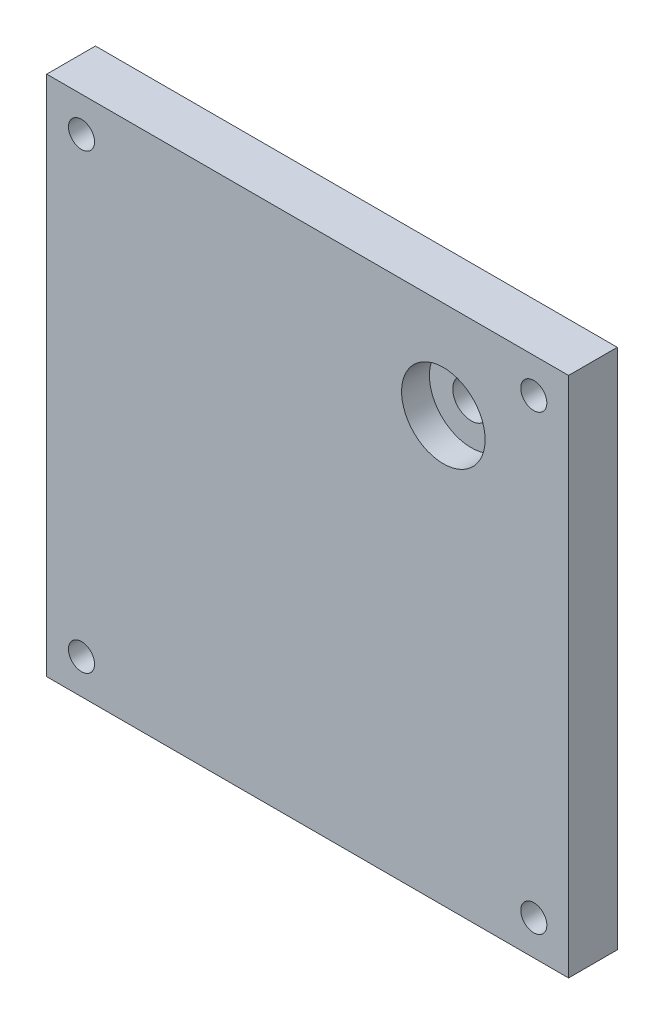
ISO-10303-21;
HEADER;
FILE_DESCRIPTION(('STEP AP214'),'2;1');
FILE_NAME('part.step','',(''),(''),'','','');
FILE_SCHEMA(('AUTOMOTIVE_DESIGN { 1 0 10303 214 1 1 1 1 }'));
ENDSEC;
DATA;
#1=APPLICATION_CONTEXT('core data for automotive mechanical design processes');
#2=APPLICATION_PROTOCOL_DEFINITION('international standard','automotive_design',2000,#1);
#3=PRODUCT_CONTEXT('',#1,'mechanical');
#4=PRODUCT('Part','Part','',(#3));
#5=PRODUCT_RELATED_PRODUCT_CATEGORY('part','',(#4));
#6=PRODUCT_DEFINITION_FORMATION('','',#4);
#7=PRODUCT_DEFINITION_CONTEXT('part definition',#1,'design');
#8=PRODUCT_DEFINITION('design','',#6,#7);
#9=PRODUCT_DEFINITION_SHAPE('','',#8);
#10=(LENGTH_UNIT() NAMED_UNIT(*) SI_UNIT(.MILLI.,.METRE.));
#11=(NAMED_UNIT(*) PLANE_ANGLE_UNIT() SI_UNIT($,.RADIAN.));
#12=(NAMED_UNIT(*) SI_UNIT($,.STERADIAN.) SOLID_ANGLE_UNIT());
#13=UNCERTAINTY_MEASURE_WITH_UNIT(LENGTH_MEASURE(1.E-05),#10,'distance_accuracy_value','');
#14=(GEOMETRIC_REPRESENTATION_CONTEXT(3) GLOBAL_UNCERTAINTY_ASSIGNED_CONTEXT((#13)) GLOBAL_UNIT_ASSIGNED_CONTEXT((#10,
#11,#12)) REPRESENTATION_CONTEXT('',''));
#15=CARTESIAN_POINT('',(0.,0.,0.));
#16=DIRECTION('',(0.,0.,1.));
#17=DIRECTION('',(1.,0.,0.));
#18=AXIS2_PLACEMENT_3D('',#15,#16,#17);
#19=CARTESIAN_POINT('',(47.625,-47.625,8.89));
#20=DIRECTION('',(-1.,0.,0.));
#21=DIRECTION('',(0.,0.,1.));
#22=AXIS2_PLACEMENT_3D('',#19,#20,#21);
#23=PLANE('',#22);
#24=DIRECTION('',(0.,1.,0.));
#25=VECTOR('',#24,1.);
#26=CARTESIAN_POINT('',(47.625,-47.625,0.));
#27=LINE('',#26,#25);
#28=CARTESIAN_POINT('',(47.625,-47.625,0.));
#29=VERTEX_POINT('',#28);
#30=CARTESIAN_POINT('',(47.625,47.625,0.));
#31=VERTEX_POINT('',#30);
#32=EDGE_CURVE('E108',#29,#31,#27,.T.);
#33=ORIENTED_EDGE('',*,*,#32,.T.);
#34=DIRECTION('',(0.,0.,-1.));
#35=VECTOR('',#34,1.);
#36=CARTESIAN_POINT('',(47.625,47.625,8.89));
#37=LINE('',#36,#35);
#38=CARTESIAN_POINT('',(47.625,47.625,8.89));
#39=VERTEX_POINT('',#38);
#40=EDGE_CURVE('E12',#39,#31,#37,.T.);
#41=ORIENTED_EDGE('',*,*,#40,.F.);
#42=DIRECTION('',(0.,1.,0.));
#43=VECTOR('',#42,1.);
#44=CARTESIAN_POINT('',(47.625,-47.625,8.89));
#45=LINE('',#44,#43);
#46=CARTESIAN_POINT('',(47.625,-47.625,8.89));
#47=VERTEX_POINT('',#46);
#48=EDGE_CURVE('E92',#47,#39,#45,.T.);
#49=ORIENTED_EDGE('',*,*,#48,.F.);
#50=DIRECTION('',(0.,0.,-1.));
#51=VECTOR('',#50,1.);
#52=CARTESIAN_POINT('',(47.625,-47.625,8.89));
#53=LINE('',#52,#51);
#54=EDGE_CURVE('E104',#47,#29,#53,.T.);
#55=ORIENTED_EDGE('',*,*,#54,.T.);
#56=EDGE_LOOP('',(#33,#41,#49,#55));
#57=FACE_BOUND('',#56,.T.);
#58=ADVANCED_FACE('F40',(#57),#23,.F.);
#59=CARTESIAN_POINT('',(-47.625,47.625,8.89));
#60=DIRECTION('',(0.,-1.,0.));
#61=DIRECTION('',(0.,0.,-1.));
#62=AXIS2_PLACEMENT_3D('',#59,#60,#61);
#63=PLANE('',#62);
#64=DIRECTION('',(-1.,0.,0.));
#65=VECTOR('',#64,1.);
#66=CARTESIAN_POINT('',(-47.625,47.625,0.));
#67=LINE('',#66,#65);
#68=CARTESIAN_POINT('',(-47.625,47.625,0.));
#69=VERTEX_POINT('',#68);
#70=EDGE_CURVE('E97',#31,#69,#67,.T.);
#71=ORIENTED_EDGE('',*,*,#70,.T.);
#72=DIRECTION('',(0.,0.,-1.));
#73=VECTOR('',#72,1.);
#74=CARTESIAN_POINT('',(-47.625,47.625,8.89));
#75=LINE('',#74,#73);
#76=CARTESIAN_POINT('',(-47.625,47.625,8.89));
#77=VERTEX_POINT('',#76);
#78=EDGE_CURVE('E49',#77,#69,#75,.T.);
#79=ORIENTED_EDGE('',*,*,#78,.F.);
#80=DIRECTION('',(-1.,0.,0.));
#81=VECTOR('',#80,1.);
#82=CARTESIAN_POINT('',(-47.625,47.625,8.89));
#83=LINE('',#82,#81);
#84=EDGE_CURVE('E87',#39,#77,#83,.T.);
#85=ORIENTED_EDGE('',*,*,#84,.F.);
#86=ORIENTED_EDGE('',*,*,#40,.T.);
#87=EDGE_LOOP('',(#71,#79,#85,#86));
#88=FACE_BOUND('',#87,.T.);
#89=ADVANCED_FACE('F96',(#88),#63,.F.);
#90=CARTESIAN_POINT('',(-47.625,-47.625,8.89));
#91=DIRECTION('',(1.,0.,0.));
#92=DIRECTION('',(0.,0.,-1.));
#93=AXIS2_PLACEMENT_3D('',#90,#91,#92);
#94=PLANE('',#93);
#95=DIRECTION('',(0.,-1.,0.));
#96=VECTOR('',#95,1.);
#97=CARTESIAN_POINT('',(-47.625,-47.625,0.));
#98=LINE('',#97,#96);
#99=CARTESIAN_POINT('',(-47.625,-47.625,0.));
#100=VERTEX_POINT('',#99);
#101=EDGE_CURVE('E74',#69,#100,#98,.T.);
#102=ORIENTED_EDGE('',*,*,#101,.T.);
#103=DIRECTION('',(0.,0.,-1.));
#104=VECTOR('',#103,1.);
#105=CARTESIAN_POINT('',(-47.625,-47.625,8.89));
#106=LINE('',#105,#104);
#107=CARTESIAN_POINT('',(-47.625,-47.625,8.89));
#108=VERTEX_POINT('',#107);
#109=EDGE_CURVE('E99',#108,#100,#106,.T.);
#110=ORIENTED_EDGE('',*,*,#109,.F.);
#111=DIRECTION('',(0.,-1.,0.));
#112=VECTOR('',#111,1.);
#113=CARTESIAN_POINT('',(-47.625,-47.625,8.89));
#114=LINE('',#113,#112);
#115=EDGE_CURVE('E90',#77,#108,#114,.T.);
#116=ORIENTED_EDGE('',*,*,#115,.F.);
#117=ORIENTED_EDGE('',*,*,#78,.T.);
#118=EDGE_LOOP('',(#102,#110,#116,#117));
#119=FACE_BOUND('',#118,.T.);
#120=ADVANCED_FACE('F100',(#119),#94,.F.);
#121=CARTESIAN_POINT('',(-47.625,-47.625,8.89));
#122=DIRECTION('',(0.,1.,0.));
#123=DIRECTION('',(0.,0.,1.));
#124=AXIS2_PLACEMENT_3D('',#121,#122,#123);
#125=PLANE('',#124);
#126=DIRECTION('',(1.,0.,0.));
#127=VECTOR('',#126,1.);
#128=CARTESIAN_POINT('',(-47.625,-47.625,0.));
#129=LINE('',#128,#127);
#130=EDGE_CURVE('E80',#100,#29,#129,.T.);
#131=ORIENTED_EDGE('',*,*,#130,.T.);
#132=ORIENTED_EDGE('',*,*,#54,.F.);
#133=DIRECTION('',(1.,0.,0.));
#134=VECTOR('',#133,1.);
#135=CARTESIAN_POINT('',(-47.625,-47.625,8.89));
#136=LINE('',#135,#134);
#137=EDGE_CURVE('E57',#108,#47,#136,.T.);
#138=ORIENTED_EDGE('',*,*,#137,.F.);
#139=ORIENTED_EDGE('',*,*,#109,.T.);
#140=EDGE_LOOP('',(#131,#132,#138,#139));
#141=FACE_BOUND('',#140,.T.);
#142=ADVANCED_FACE('F122',(#141),#125,.F.);
#143=CARTESIAN_POINT('',(0.,0.,8.89));
#144=DIRECTION('',(0.,0.,-1.));
#145=DIRECTION('',(-1.,0.,0.));
#146=AXIS2_PLACEMENT_3D('',#143,#144,#145);
#147=PLANE('',#146);
#148=CARTESIAN_POINT('',(24.765,29.845,8.89));
#149=DIRECTION('',(0.,0.,1.));
#150=DIRECTION('',(1.,0.,0.));
#151=AXIS2_PLACEMENT_3D('',#148,#149,#150);
#152=CIRCLE('',#151,7.62);
#153=CARTESIAN_POINT('',(32.385,29.845,8.89));
#154=VERTEX_POINT('',#153);
#155=EDGE_CURVE('E161',#154,#154,#152,.T.);
#156=ORIENTED_EDGE('',*,*,#155,.F.);
#157=EDGE_LOOP('',(#156));
#158=FACE_BOUND('',#157,.T.);
#159=CARTESIAN_POINT('',(41.275,-41.275,8.89));
#160=DIRECTION('',(0.,0.,1.));
#161=DIRECTION('',(1.,0.,0.));
#162=AXIS2_PLACEMENT_3D('',#159,#160,#161);
#163=CIRCLE('',#162,2.38125);
#164=CARTESIAN_POINT('',(43.65625,-41.275,8.89));
#165=VERTEX_POINT('',#164);
#166=EDGE_CURVE('E146',#165,#165,#163,.T.);
#167=ORIENTED_EDGE('',*,*,#166,.F.);
#168=EDGE_LOOP('',(#167));
#169=FACE_BOUND('',#168,.T.);
#170=CARTESIAN_POINT('',(-41.275,-41.275,8.89));
#171=DIRECTION('',(0.,0.,1.));
#172=DIRECTION('',(1.,0.,0.));
#173=AXIS2_PLACEMENT_3D('',#170,#171,#172);
#174=CIRCLE('',#173,2.38125);
#175=CARTESIAN_POINT('',(-38.89375,-41.275,8.89));
#176=VERTEX_POINT('',#175);
#177=EDGE_CURVE('E137',#176,#176,#174,.T.);
#178=ORIENTED_EDGE('',*,*,#177,.F.);
#179=EDGE_LOOP('',(#178));
#180=FACE_BOUND('',#179,.T.);
#181=CARTESIAN_POINT('',(-41.275,41.275,8.89));
#182=DIRECTION('',(0.,0.,1.));
#183=DIRECTION('',(1.,0.,0.));
#184=AXIS2_PLACEMENT_3D('',#181,#182,#183);
#185=CIRCLE('',#184,2.38125);
#186=CARTESIAN_POINT('',(-38.89375,41.275,8.89));
#187=VERTEX_POINT('',#186);
#188=EDGE_CURVE('E153',#187,#187,#185,.T.);
#189=ORIENTED_EDGE('',*,*,#188,.F.);
#190=EDGE_LOOP('',(#189));
#191=FACE_BOUND('',#190,.T.);
#192=CARTESIAN_POINT('',(41.275,41.275,8.89));
#193=DIRECTION('',(0.,0.,1.));
#194=DIRECTION('',(1.,0.,0.));
#195=AXIS2_PLACEMENT_3D('',#192,#193,#194);
#196=CIRCLE('',#195,2.38125);
#197=CARTESIAN_POINT('',(43.65625,41.275,8.89));
#198=VERTEX_POINT('',#197);
#199=EDGE_CURVE('E129',#198,#198,#196,.T.);
#200=ORIENTED_EDGE('',*,*,#199,.F.);
#201=EDGE_LOOP('',(#200));
#202=FACE_BOUND('',#201,.T.);
#203=ORIENTED_EDGE('',*,*,#48,.T.);
#204=ORIENTED_EDGE('',*,*,#84,.T.);
#205=ORIENTED_EDGE('',*,*,#115,.T.);
#206=ORIENTED_EDGE('',*,*,#137,.T.);
#207=EDGE_LOOP('',(#203,#204,#205,#206));
#208=FACE_BOUND('',#207,.T.);
#209=ADVANCED_FACE('F88',(#158,#169,#180,#191,#202,#208),#147,.F.);
#210=CARTESIAN_POINT('',(0.,0.,0.));
#211=DIRECTION('',(0.,0.,-1.));
#212=DIRECTION('',(-1.,0.,0.));
#213=AXIS2_PLACEMENT_3D('',#210,#211,#212);
#214=PLANE('',#213);
#215=CARTESIAN_POINT('',(24.765,29.845,0.));
#216=DIRECTION('',(0.,0.,1.));
#217=DIRECTION('',(1.,0.,0.));
#218=AXIS2_PLACEMENT_3D('',#215,#216,#217);
#219=CIRCLE('',#218,3.3655);
#220=CARTESIAN_POINT('',(28.1305,29.845,0.));
#221=VERTEX_POINT('',#220);
#222=EDGE_CURVE('E165',#221,#221,#219,.T.);
#223=ORIENTED_EDGE('',*,*,#222,.T.);
#224=EDGE_LOOP('',(#223));
#225=FACE_BOUND('',#224,.T.);
#226=CARTESIAN_POINT('',(41.275,-41.275,0.));
#227=DIRECTION('',(0.,0.,1.));
#228=DIRECTION('',(1.,0.,0.));
#229=AXIS2_PLACEMENT_3D('',#226,#227,#228);
#230=CIRCLE('',#229,2.38125);
#231=CARTESIAN_POINT('',(43.65625,-41.275,0.));
#232=VERTEX_POINT('',#231);
#233=EDGE_CURVE('E133',#232,#232,#230,.T.);
#234=ORIENTED_EDGE('',*,*,#233,.T.);
#235=EDGE_LOOP('',(#234));
#236=FACE_BOUND('',#235,.T.);
#237=CARTESIAN_POINT('',(-41.275,-41.275,0.));
#238=DIRECTION('',(0.,0.,1.));
#239=DIRECTION('',(1.,0.,0.));
#240=AXIS2_PLACEMENT_3D('',#237,#238,#239);
#241=CIRCLE('',#240,2.38125);
#242=CARTESIAN_POINT('',(-38.89375,-41.275,0.));
#243=VERTEX_POINT('',#242);
#244=EDGE_CURVE('E141',#243,#243,#241,.T.);
#245=ORIENTED_EDGE('',*,*,#244,.T.);
#246=EDGE_LOOP('',(#245));
#247=FACE_BOUND('',#246,.T.);
#248=CARTESIAN_POINT('',(-41.275,41.275,0.));
#249=DIRECTION('',(0.,0.,1.));
#250=DIRECTION('',(1.,0.,0.));
#251=AXIS2_PLACEMENT_3D('',#248,#249,#250);
#252=CIRCLE('',#251,2.38125);
#253=CARTESIAN_POINT('',(-38.89375,41.275,0.));
#254=VERTEX_POINT('',#253);
#255=EDGE_CURVE('E142',#254,#254,#252,.T.);
#256=ORIENTED_EDGE('',*,*,#255,.T.);
#257=EDGE_LOOP('',(#256));
#258=FACE_BOUND('',#257,.T.);
#259=CARTESIAN_POINT('',(41.275,41.275,0.));
#260=DIRECTION('',(0.,0.,1.));
#261=DIRECTION('',(1.,0.,0.));
#262=AXIS2_PLACEMENT_3D('',#259,#260,#261);
#263=CIRCLE('',#262,2.38125);
#264=CARTESIAN_POINT('',(43.65625,41.275,0.));
#265=VERTEX_POINT('',#264);
#266=EDGE_CURVE('E112',#265,#265,#263,.T.);
#267=ORIENTED_EDGE('',*,*,#266,.T.);
#268=EDGE_LOOP('',(#267));
#269=FACE_BOUND('',#268,.T.);
#270=ORIENTED_EDGE('',*,*,#32,.F.);
#271=ORIENTED_EDGE('',*,*,#130,.F.);
#272=ORIENTED_EDGE('',*,*,#101,.F.);
#273=ORIENTED_EDGE('',*,*,#70,.F.);
#274=EDGE_LOOP('',(#270,#271,#272,#273));
#275=FACE_BOUND('',#274,.T.);
#276=ADVANCED_FACE('F125',(#225,#236,#247,#258,#269,#275),#214,.T.);
#277=CARTESIAN_POINT('',(41.275,41.275,0.));
#278=DIRECTION('',(0.,0.,1.));
#279=DIRECTION('',(1.,0.,0.));
#280=AXIS2_PLACEMENT_3D('',#277,#278,#279);
#281=CYLINDRICAL_SURFACE('',#280,2.38125);
#282=ORIENTED_EDGE('',*,*,#266,.F.);
#283=EDGE_LOOP('',(#282));
#284=FACE_BOUND('',#283,.T.);
#285=ORIENTED_EDGE('',*,*,#199,.T.);
#286=EDGE_LOOP('',(#285));
#287=FACE_BOUND('',#286,.T.);
#288=ADVANCED_FACE('F209',(#284,#287),#281,.F.);
#289=CARTESIAN_POINT('',(-41.275,41.275,0.));
#290=DIRECTION('',(0.,0.,1.));
#291=DIRECTION('',(1.,0.,0.));
#292=AXIS2_PLACEMENT_3D('',#289,#290,#291);
#293=CYLINDRICAL_SURFACE('',#292,2.38125);
#294=ORIENTED_EDGE('',*,*,#255,.F.);
#295=EDGE_LOOP('',(#294));
#296=FACE_BOUND('',#295,.T.);
#297=ORIENTED_EDGE('',*,*,#188,.T.);
#298=EDGE_LOOP('',(#297));
#299=FACE_BOUND('',#298,.T.);
#300=ADVANCED_FACE('F211',(#296,#299),#293,.F.);
#301=CARTESIAN_POINT('',(-41.275,-41.275,0.));
#302=DIRECTION('',(0.,0.,1.));
#303=DIRECTION('',(1.,0.,0.));
#304=AXIS2_PLACEMENT_3D('',#301,#302,#303);
#305=CYLINDRICAL_SURFACE('',#304,2.38125);
#306=ORIENTED_EDGE('',*,*,#244,.F.);
#307=EDGE_LOOP('',(#306));
#308=FACE_BOUND('',#307,.T.);
#309=ORIENTED_EDGE('',*,*,#177,.T.);
#310=EDGE_LOOP('',(#309));
#311=FACE_BOUND('',#310,.T.);
#312=ADVANCED_FACE('F218',(#308,#311),#305,.F.);
#313=CARTESIAN_POINT('',(41.275,-41.275,0.));
#314=DIRECTION('',(0.,0.,1.));
#315=DIRECTION('',(1.,0.,0.));
#316=AXIS2_PLACEMENT_3D('',#313,#314,#315);
#317=CYLINDRICAL_SURFACE('',#316,2.38125);
#318=ORIENTED_EDGE('',*,*,#233,.F.);
#319=EDGE_LOOP('',(#318));
#320=FACE_BOUND('',#319,.T.);
#321=ORIENTED_EDGE('',*,*,#166,.T.);
#322=EDGE_LOOP('',(#321));
#323=FACE_BOUND('',#322,.T.);
#324=ADVANCED_FACE('F194',(#320,#323),#317,.F.);
#325=CARTESIAN_POINT('',(24.765,29.845,3.81));
#326=DIRECTION('',(0.,0.,1.));
#327=DIRECTION('',(1.,0.,0.));
#328=AXIS2_PLACEMENT_3D('',#325,#326,#327);
#329=CYLINDRICAL_SURFACE('',#328,7.62);
#330=CARTESIAN_POINT('',(24.765,29.845,3.81));
#331=DIRECTION('',(0.,0.,1.));
#332=DIRECTION('',(1.,0.,0.));
#333=AXIS2_PLACEMENT_3D('',#330,#331,#332);
#334=CIRCLE('',#333,7.62);
#335=CARTESIAN_POINT('',(32.385,29.845,3.81));
#336=VERTEX_POINT('',#335);
#337=EDGE_CURVE('E157',#336,#336,#334,.T.);
#338=ORIENTED_EDGE('',*,*,#337,.F.);
#339=EDGE_LOOP('',(#338));
#340=FACE_BOUND('',#339,.T.);
#341=ORIENTED_EDGE('',*,*,#155,.T.);
#342=EDGE_LOOP('',(#341));
#343=FACE_BOUND('',#342,.T.);
#344=ADVANCED_FACE('F188',(#340,#343),#329,.F.);
#345=CARTESIAN_POINT('',(24.765,29.845,3.81));
#346=DIRECTION('',(0.,0.,1.));
#347=DIRECTION('',(1.,0.,0.));
#348=AXIS2_PLACEMENT_3D('',#345,#346,#347);
#349=PLANE('',#348);
#350=CARTESIAN_POINT('',(24.765,29.845,3.81));
#351=DIRECTION('',(0.,0.,1.));
#352=DIRECTION('',(1.,0.,0.));
#353=AXIS2_PLACEMENT_3D('',#350,#351,#352);
#354=CIRCLE('',#353,3.3655);
#355=CARTESIAN_POINT('',(28.1305,29.845,3.81));
#356=VERTEX_POINT('',#355);
#357=EDGE_CURVE('E169',#356,#356,#354,.T.);
#358=ORIENTED_EDGE('',*,*,#357,.F.);
#359=EDGE_LOOP('',(#358));
#360=FACE_BOUND('',#359,.T.);
#361=ORIENTED_EDGE('',*,*,#337,.T.);
#362=EDGE_LOOP('',(#361));
#363=FACE_BOUND('',#362,.T.);
#364=ADVANCED_FACE('F182',(#360,#363),#349,.T.);
#365=CARTESIAN_POINT('',(24.765,29.845,0.));
#366=DIRECTION('',(0.,0.,1.));
#367=DIRECTION('',(1.,0.,0.));
#368=AXIS2_PLACEMENT_3D('',#365,#366,#367);
#369=CYLINDRICAL_SURFACE('',#368,3.3655);
#370=ORIENTED_EDGE('',*,*,#222,.F.);
#371=EDGE_LOOP('',(#370));
#372=FACE_BOUND('',#371,.T.);
#373=ORIENTED_EDGE('',*,*,#357,.T.);
#374=EDGE_LOOP('',(#373));
#375=FACE_BOUND('',#374,.T.);
#376=ADVANCED_FACE('F179',(#372,#375),#369,.F.);
#377=CLOSED_SHELL('',(#58,#89,#120,#142,#209,#276,#288,#300,#312,#324,#344,#364,#376));
#378=MANIFOLD_SOLID_BREP('B2',#377);
#379=ADVANCED_BREP_SHAPE_REPRESENTATION('',(#18,#378),#14);
#380=SHAPE_DEFINITION_REPRESENTATION(#9,#379);
ENDSEC;
END-ISO-10303-21;
